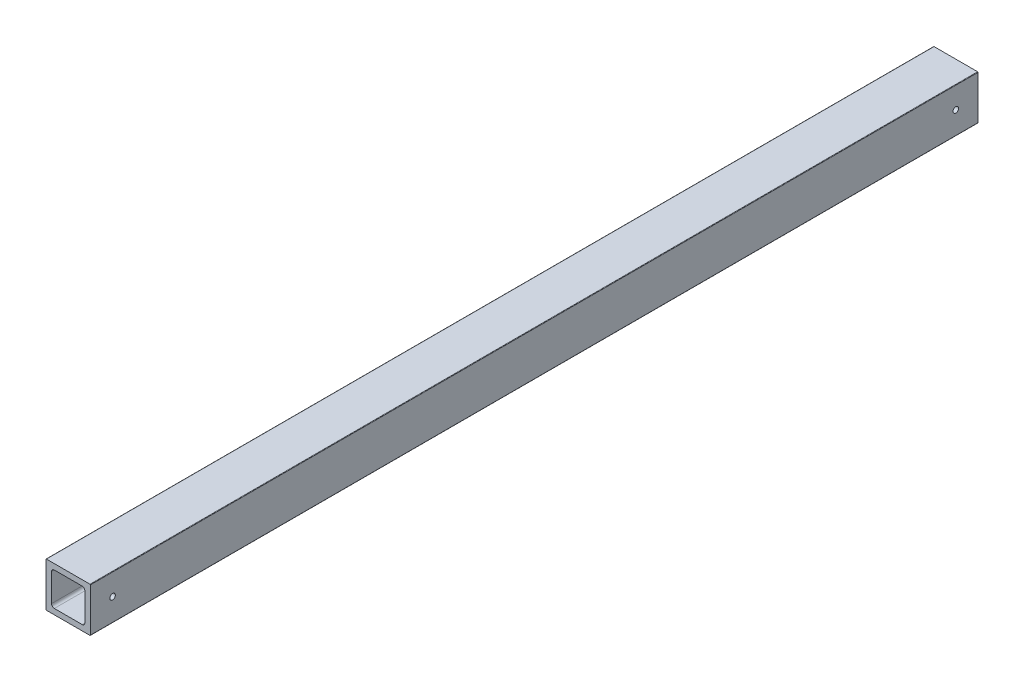
ISO-10303-21;
HEADER;
FILE_DESCRIPTION(('STEP AP214'),'2;1');
FILE_NAME('part.step','',(''),(''),'','','');
FILE_SCHEMA(('AUTOMOTIVE_DESIGN { 1 0 10303 214 1 1 1 1 }'));
ENDSEC;
DATA;
#1=APPLICATION_CONTEXT('core data for automotive mechanical design processes');
#2=APPLICATION_PROTOCOL_DEFINITION('international standard','automotive_design',2000,#1);
#3=PRODUCT_CONTEXT('',#1,'mechanical');
#4=PRODUCT('Part','Part','',(#3));
#5=PRODUCT_RELATED_PRODUCT_CATEGORY('part','',(#4));
#6=PRODUCT_DEFINITION_FORMATION('','',#4);
#7=PRODUCT_DEFINITION_CONTEXT('part definition',#1,'design');
#8=PRODUCT_DEFINITION('design','',#6,#7);
#9=PRODUCT_DEFINITION_SHAPE('','',#8);
#10=(LENGTH_UNIT() NAMED_UNIT(*) SI_UNIT(.MILLI.,.METRE.));
#11=(NAMED_UNIT(*) PLANE_ANGLE_UNIT() SI_UNIT($,.RADIAN.));
#12=(NAMED_UNIT(*) SI_UNIT($,.STERADIAN.) SOLID_ANGLE_UNIT());
#13=UNCERTAINTY_MEASURE_WITH_UNIT(LENGTH_MEASURE(1.E-05),#10,'distance_accuracy_value','');
#14=(GEOMETRIC_REPRESENTATION_CONTEXT(3) GLOBAL_UNCERTAINTY_ASSIGNED_CONTEXT((#13)) GLOBAL_UNIT_ASSIGNED_CONTEXT((#10,
#11,#12)) REPRESENTATION_CONTEXT('',''));
#15=CARTESIAN_POINT('',(0.,0.,0.));
#16=DIRECTION('',(0.,0.,1.));
#17=DIRECTION('',(1.,0.,0.));
#18=AXIS2_PLACEMENT_3D('',#15,#16,#17);
#19=CARTESIAN_POINT('',(0.253999999999993,0.253999999999998,508.));
#20=DIRECTION('',(0.,0.,-1.));
#21=DIRECTION('',(-1.,0.,0.));
#22=AXIS2_PLACEMENT_3D('',#19,#20,#21);
#23=CYLINDRICAL_SURFACE('',#22,0.253999999999997);
#24=CARTESIAN_POINT('',(0.253999999999993,0.253999999999998,0.));
#25=DIRECTION('',(0.,0.,-1.));
#26=DIRECTION('',(-1.,0.,0.));
#27=AXIS2_PLACEMENT_3D('',#24,#25,#26);
#28=CIRCLE('',#27,0.253999999999997);
#29=CARTESIAN_POINT('',(0.253999999999993,0.,0.));
#30=VERTEX_POINT('',#29);
#31=CARTESIAN_POINT('',(0.,0.253999999999998,0.));
#32=VERTEX_POINT('',#31);
#33=EDGE_CURVE('E206',#30,#32,#28,.T.);
#34=ORIENTED_EDGE('',*,*,#33,.F.);
#35=DIRECTION('',(0.,0.,-1.));
#36=VECTOR('',#35,1.);
#37=CARTESIAN_POINT('',(0.253999999999993,0.,508.));
#38=LINE('',#37,#36);
#39=CARTESIAN_POINT('',(0.253999999999993,0.,508.));
#40=VERTEX_POINT('',#39);
#41=EDGE_CURVE('E11',#40,#30,#38,.T.);
#42=ORIENTED_EDGE('',*,*,#41,.F.);
#43=CARTESIAN_POINT('',(0.253999999999993,0.253999999999998,508.));
#44=DIRECTION('',(0.,0.,-1.));
#45=DIRECTION('',(-1.,0.,0.));
#46=AXIS2_PLACEMENT_3D('',#43,#44,#45);
#47=CIRCLE('',#46,0.253999999999997);
#48=CARTESIAN_POINT('',(0.,0.253999999999998,508.));
#49=VERTEX_POINT('',#48);
#50=EDGE_CURVE('E218',#40,#49,#47,.T.);
#51=ORIENTED_EDGE('',*,*,#50,.T.);
#52=DIRECTION('',(0.,0.,-1.));
#53=VECTOR('',#52,1.);
#54=CARTESIAN_POINT('',(0.,0.253999999999998,508.));
#55=LINE('',#54,#53);
#56=EDGE_CURVE('E243',#49,#32,#55,.T.);
#57=ORIENTED_EDGE('',*,*,#56,.T.);
#58=EDGE_LOOP('',(#34,#42,#51,#57));
#59=FACE_BOUND('',#58,.T.);
#60=ADVANCED_FACE('F33',(#59),#23,.T.);
#61=CARTESIAN_POINT('',(25.146,0.,508.));
#62=DIRECTION('',(0.,-1.,0.));
#63=DIRECTION('',(1.,0.,0.));
#64=AXIS2_PLACEMENT_3D('',#61,#62,#63);
#65=PLANE('',#64);
#66=DIRECTION('',(-1.,0.,0.));
#67=VECTOR('',#66,1.);
#68=CARTESIAN_POINT('',(25.146,0.,0.));
#69=LINE('',#68,#67);
#70=CARTESIAN_POINT('',(25.146,0.,0.));
#71=VERTEX_POINT('',#70);
#72=EDGE_CURVE('E222',#71,#30,#69,.T.);
#73=ORIENTED_EDGE('',*,*,#72,.F.);
#74=DIRECTION('',(0.,0.,-1.));
#75=VECTOR('',#74,1.);
#76=CARTESIAN_POINT('',(25.146,0.,508.));
#77=LINE('',#76,#75);
#78=CARTESIAN_POINT('',(25.146,0.,508.));
#79=VERTEX_POINT('',#78);
#80=EDGE_CURVE('E41',#79,#71,#77,.T.);
#81=ORIENTED_EDGE('',*,*,#80,.F.);
#82=DIRECTION('',(-1.,0.,0.));
#83=VECTOR('',#82,1.);
#84=CARTESIAN_POINT('',(25.146,0.,508.));
#85=LINE('',#84,#83);
#86=EDGE_CURVE('E240',#79,#40,#85,.T.);
#87=ORIENTED_EDGE('',*,*,#86,.T.);
#88=ORIENTED_EDGE('',*,*,#41,.T.);
#89=EDGE_LOOP('',(#73,#81,#87,#88));
#90=FACE_BOUND('',#89,.T.);
#91=ADVANCED_FACE('F320',(#90),#65,.T.);
#92=CARTESIAN_POINT('',(25.146,0.254,508.));
#93=DIRECTION('',(0.,0.,-1.));
#94=DIRECTION('',(-1.,0.,0.));
#95=AXIS2_PLACEMENT_3D('',#92,#93,#94);
#96=CYLINDRICAL_SURFACE('',#95,0.253999999999999);
#97=CARTESIAN_POINT('',(25.146,0.254,0.));
#98=DIRECTION('',(0.,0.,-1.));
#99=DIRECTION('',(-1.,0.,0.));
#100=AXIS2_PLACEMENT_3D('',#97,#98,#99);
#101=CIRCLE('',#100,0.253999999999999);
#102=CARTESIAN_POINT('',(25.4,0.254,0.));
#103=VERTEX_POINT('',#102);
#104=EDGE_CURVE('E261',#103,#71,#101,.T.);
#105=ORIENTED_EDGE('',*,*,#104,.F.);
#106=DIRECTION('',(0.,0.,-1.));
#107=VECTOR('',#106,1.);
#108=CARTESIAN_POINT('',(25.4,0.254,508.));
#109=LINE('',#108,#107);
#110=CARTESIAN_POINT('',(25.4,0.254,508.));
#111=VERTEX_POINT('',#110);
#112=EDGE_CURVE('E267',#111,#103,#109,.T.);
#113=ORIENTED_EDGE('',*,*,#112,.F.);
#114=CARTESIAN_POINT('',(25.146,0.254,508.));
#115=DIRECTION('',(0.,0.,-1.));
#116=DIRECTION('',(-1.,0.,0.));
#117=AXIS2_PLACEMENT_3D('',#114,#115,#116);
#118=CIRCLE('',#117,0.253999999999999);
#119=EDGE_CURVE('E237',#111,#79,#118,.T.);
#120=ORIENTED_EDGE('',*,*,#119,.T.);
#121=ORIENTED_EDGE('',*,*,#80,.T.);
#122=EDGE_LOOP('',(#105,#113,#120,#121));
#123=FACE_BOUND('',#122,.T.);
#124=ADVANCED_FACE('F323',(#123),#96,.T.);
#125=CARTESIAN_POINT('',(25.4,25.146,508.));
#126=DIRECTION('',(1.,0.,0.));
#127=DIRECTION('',(0.,0.,-1.));
#128=AXIS2_PLACEMENT_3D('',#125,#126,#127);
#129=PLANE('',#128);
#130=CARTESIAN_POINT('',(25.4,12.954,12.6974597459492));
#131=DIRECTION('',(-1.,0.,0.));
#132=DIRECTION('',(0.,0.,1.));
#133=AXIS2_PLACEMENT_3D('',#130,#131,#132);
#134=CIRCLE('',#133,1.5875);
#135=CARTESIAN_POINT('',(25.4,12.954,14.2849597459492));
#136=VERTEX_POINT('',#135);
#137=EDGE_CURVE('E280',#136,#136,#134,.T.);
#138=ORIENTED_EDGE('',*,*,#137,.T.);
#139=EDGE_LOOP('',(#138));
#140=FACE_BOUND('',#139,.T.);
#141=CARTESIAN_POINT('',(25.4,12.954,495.3));
#142=DIRECTION('',(-1.,0.,0.));
#143=DIRECTION('',(0.,0.,1.));
#144=AXIS2_PLACEMENT_3D('',#141,#142,#143);
#145=CIRCLE('',#144,1.58750000000004);
#146=CARTESIAN_POINT('',(25.4,12.954,496.8875));
#147=VERTEX_POINT('',#146);
#148=EDGE_CURVE('E290',#147,#147,#145,.T.);
#149=ORIENTED_EDGE('',*,*,#148,.T.);
#150=EDGE_LOOP('',(#149));
#151=FACE_BOUND('',#150,.T.);
#152=DIRECTION('',(0.,-1.,0.));
#153=VECTOR('',#152,1.);
#154=CARTESIAN_POINT('',(25.4,25.146,0.));
#155=LINE('',#154,#153);
#156=CARTESIAN_POINT('',(25.4,25.146,0.));
#157=VERTEX_POINT('',#156);
#158=EDGE_CURVE('E258',#157,#103,#155,.T.);
#159=ORIENTED_EDGE('',*,*,#158,.F.);
#160=DIRECTION('',(0.,0.,-1.));
#161=VECTOR('',#160,1.);
#162=CARTESIAN_POINT('',(25.4,25.146,508.));
#163=LINE('',#162,#161);
#164=CARTESIAN_POINT('',(25.4,25.146,508.));
#165=VERTEX_POINT('',#164);
#166=EDGE_CURVE('E269',#165,#157,#163,.T.);
#167=ORIENTED_EDGE('',*,*,#166,.F.);
#168=DIRECTION('',(0.,-1.,0.));
#169=VECTOR('',#168,1.);
#170=CARTESIAN_POINT('',(25.4,25.146,508.));
#171=LINE('',#170,#169);
#172=EDGE_CURVE('E234',#165,#111,#171,.T.);
#173=ORIENTED_EDGE('',*,*,#172,.T.);
#174=ORIENTED_EDGE('',*,*,#112,.T.);
#175=EDGE_LOOP('',(#159,#167,#173,#174));
#176=FACE_BOUND('',#175,.T.);
#177=ADVANCED_FACE('F328',(#140,#151,#176),#129,.T.);
#178=CARTESIAN_POINT('',(25.146,25.146,508.));
#179=DIRECTION('',(0.,0.,-1.));
#180=DIRECTION('',(-1.,0.,0.));
#181=AXIS2_PLACEMENT_3D('',#178,#179,#180);
#182=CYLINDRICAL_SURFACE('',#181,0.253999999999999);
#183=CARTESIAN_POINT('',(25.146,25.146,0.));
#184=DIRECTION('',(0.,0.,-1.));
#185=DIRECTION('',(-1.,0.,0.));
#186=AXIS2_PLACEMENT_3D('',#183,#184,#185);
#187=CIRCLE('',#186,0.253999999999999);
#188=CARTESIAN_POINT('',(25.146,25.4,0.));
#189=VERTEX_POINT('',#188);
#190=EDGE_CURVE('E255',#189,#157,#187,.T.);
#191=ORIENTED_EDGE('',*,*,#190,.F.);
#192=DIRECTION('',(0.,0.,-1.));
#193=VECTOR('',#192,1.);
#194=CARTESIAN_POINT('',(25.146,25.4,508.));
#195=LINE('',#194,#193);
#196=CARTESIAN_POINT('',(25.146,25.4,508.));
#197=VERTEX_POINT('',#196);
#198=EDGE_CURVE('E271',#197,#189,#195,.T.);
#199=ORIENTED_EDGE('',*,*,#198,.F.);
#200=CARTESIAN_POINT('',(25.146,25.146,508.));
#201=DIRECTION('',(0.,0.,-1.));
#202=DIRECTION('',(-1.,0.,0.));
#203=AXIS2_PLACEMENT_3D('',#200,#201,#202);
#204=CIRCLE('',#203,0.253999999999999);
#205=EDGE_CURVE('E231',#197,#165,#204,.T.);
#206=ORIENTED_EDGE('',*,*,#205,.T.);
#207=ORIENTED_EDGE('',*,*,#166,.T.);
#208=EDGE_LOOP('',(#191,#199,#206,#207));
#209=FACE_BOUND('',#208,.T.);
#210=ADVANCED_FACE('F331',(#209),#182,.T.);
#211=CARTESIAN_POINT('',(0.253999999999988,25.4,508.));
#212=DIRECTION('',(0.,1.,0.));
#213=DIRECTION('',(-1.,0.,0.));
#214=AXIS2_PLACEMENT_3D('',#211,#212,#213);
#215=PLANE('',#214);
#216=DIRECTION('',(1.,0.,0.));
#217=VECTOR('',#216,1.);
#218=CARTESIAN_POINT('',(0.253999999999988,25.4,0.));
#219=LINE('',#218,#217);
#220=CARTESIAN_POINT('',(0.253999999999988,25.4,0.));
#221=VERTEX_POINT('',#220);
#222=EDGE_CURVE('E252',#221,#189,#219,.T.);
#223=ORIENTED_EDGE('',*,*,#222,.F.);
#224=DIRECTION('',(0.,0.,-1.));
#225=VECTOR('',#224,1.);
#226=CARTESIAN_POINT('',(0.253999999999988,25.4,508.));
#227=LINE('',#226,#225);
#228=CARTESIAN_POINT('',(0.253999999999988,25.4,508.));
#229=VERTEX_POINT('',#228);
#230=EDGE_CURVE('E273',#229,#221,#227,.T.);
#231=ORIENTED_EDGE('',*,*,#230,.F.);
#232=DIRECTION('',(1.,0.,0.));
#233=VECTOR('',#232,1.);
#234=CARTESIAN_POINT('',(0.253999999999988,25.4,508.));
#235=LINE('',#234,#233);
#236=EDGE_CURVE('E228',#229,#197,#235,.T.);
#237=ORIENTED_EDGE('',*,*,#236,.T.);
#238=ORIENTED_EDGE('',*,*,#198,.T.);
#239=EDGE_LOOP('',(#223,#231,#237,#238));
#240=FACE_BOUND('',#239,.T.);
#241=ADVANCED_FACE('F335',(#240),#215,.T.);
#242=CARTESIAN_POINT('',(0.253999999999988,25.146,508.));
#243=DIRECTION('',(0.,0.,-1.));
#244=DIRECTION('',(-1.,0.,0.));
#245=AXIS2_PLACEMENT_3D('',#242,#243,#244);
#246=CYLINDRICAL_SURFACE('',#245,0.253999999999991);
#247=CARTESIAN_POINT('',(0.253999999999988,25.146,0.));
#248=DIRECTION('',(0.,0.,-1.));
#249=DIRECTION('',(-1.,0.,0.));
#250=AXIS2_PLACEMENT_3D('',#247,#248,#249);
#251=CIRCLE('',#250,0.253999999999991);
#252=CARTESIAN_POINT('',(0.,25.146,0.));
#253=VERTEX_POINT('',#252);
#254=EDGE_CURVE('E249',#253,#221,#251,.T.);
#255=ORIENTED_EDGE('',*,*,#254,.F.);
#256=DIRECTION('',(0.,0.,-1.));
#257=VECTOR('',#256,1.);
#258=CARTESIAN_POINT('',(0.,25.146,508.));
#259=LINE('',#258,#257);
#260=CARTESIAN_POINT('',(0.,25.146,508.));
#261=VERTEX_POINT('',#260);
#262=EDGE_CURVE('E275',#261,#253,#259,.T.);
#263=ORIENTED_EDGE('',*,*,#262,.F.);
#264=CARTESIAN_POINT('',(0.253999999999988,25.146,508.));
#265=DIRECTION('',(0.,0.,-1.));
#266=DIRECTION('',(-1.,0.,0.));
#267=AXIS2_PLACEMENT_3D('',#264,#265,#266);
#268=CIRCLE('',#267,0.253999999999991);
#269=EDGE_CURVE('E225',#261,#229,#268,.T.);
#270=ORIENTED_EDGE('',*,*,#269,.T.);
#271=ORIENTED_EDGE('',*,*,#230,.T.);
#272=EDGE_LOOP('',(#255,#263,#270,#271));
#273=FACE_BOUND('',#272,.T.);
#274=ADVANCED_FACE('F305',(#273),#246,.T.);
#275=CARTESIAN_POINT('',(0.,0.253999999999998,508.));
#276=DIRECTION('',(-1.,0.,0.));
#277=DIRECTION('',(0.,0.,1.));
#278=AXIS2_PLACEMENT_3D('',#275,#276,#277);
#279=PLANE('',#278);
#280=CARTESIAN_POINT('',(0.,12.954,12.6974597459492));
#281=DIRECTION('',(-1.,0.,0.));
#282=DIRECTION('',(0.,0.,1.));
#283=AXIS2_PLACEMENT_3D('',#280,#281,#282);
#284=CIRCLE('',#283,1.5875);
#285=CARTESIAN_POINT('',(0.,12.954,14.2849597459492));
#286=VERTEX_POINT('',#285);
#287=EDGE_CURVE('E285',#286,#286,#284,.T.);
#288=ORIENTED_EDGE('',*,*,#287,.F.);
#289=EDGE_LOOP('',(#288));
#290=FACE_BOUND('',#289,.T.);
#291=CARTESIAN_POINT('',(0.,12.954,495.3));
#292=DIRECTION('',(-1.,0.,0.));
#293=DIRECTION('',(0.,0.,1.));
#294=AXIS2_PLACEMENT_3D('',#291,#292,#293);
#295=CIRCLE('',#294,1.58750000000004);
#296=CARTESIAN_POINT('',(0.,12.954,496.8875));
#297=VERTEX_POINT('',#296);
#298=EDGE_CURVE('E295',#297,#297,#295,.T.);
#299=ORIENTED_EDGE('',*,*,#298,.F.);
#300=EDGE_LOOP('',(#299));
#301=FACE_BOUND('',#300,.T.);
#302=DIRECTION('',(0.,1.,0.));
#303=VECTOR('',#302,1.);
#304=CARTESIAN_POINT('',(0.,0.253999999999998,0.));
#305=LINE('',#304,#303);
#306=EDGE_CURVE('E246',#32,#253,#305,.T.);
#307=ORIENTED_EDGE('',*,*,#306,.F.);
#308=ORIENTED_EDGE('',*,*,#56,.F.);
#309=DIRECTION('',(0.,1.,0.));
#310=VECTOR('',#309,1.);
#311=CARTESIAN_POINT('',(0.,0.253999999999998,508.));
#312=LINE('',#311,#310);
#313=EDGE_CURVE('E221',#49,#261,#312,.T.);
#314=ORIENTED_EDGE('',*,*,#313,.T.);
#315=ORIENTED_EDGE('',*,*,#262,.T.);
#316=EDGE_LOOP('',(#307,#308,#314,#315));
#317=FACE_BOUND('',#316,.T.);
#318=ADVANCED_FACE('F302',(#290,#301,#317),#279,.T.);
#319=CARTESIAN_POINT('',(0.253999999999993,0.253999999999998,508.));
#320=DIRECTION('',(0.,0.,-1.));
#321=DIRECTION('',(-1.,0.,0.));
#322=AXIS2_PLACEMENT_3D('',#319,#320,#321);
#323=PLANE('',#322);
#324=DIRECTION('',(0.,1.,0.));
#325=VECTOR('',#324,1.);
#326=CARTESIAN_POINT('',(3.175,20.6375,508.));
#327=LINE('',#326,#325);
#328=CARTESIAN_POINT('',(3.175,4.7625,508.));
#329=VERTEX_POINT('',#328);
#330=CARTESIAN_POINT('',(3.175,20.6375,508.));
#331=VERTEX_POINT('',#330);
#332=EDGE_CURVE('E154',#329,#331,#327,.T.);
#333=ORIENTED_EDGE('',*,*,#332,.T.);
#334=CARTESIAN_POINT('',(4.76250000000001,20.6375,508.));
#335=DIRECTION('',(0.,0.,-1.));
#336=DIRECTION('',(1.,0.,0.));
#337=AXIS2_PLACEMENT_3D('',#334,#335,#336);
#338=CIRCLE('',#337,1.58750000000001);
#339=CARTESIAN_POINT('',(4.76250000000001,22.225,508.));
#340=VERTEX_POINT('',#339);
#341=EDGE_CURVE('E148',#331,#340,#338,.T.);
#342=ORIENTED_EDGE('',*,*,#341,.T.);
#343=DIRECTION('',(1.,0.,0.));
#344=VECTOR('',#343,1.);
#345=CARTESIAN_POINT('',(20.6375,22.225,508.));
#346=LINE('',#345,#344);
#347=CARTESIAN_POINT('',(20.6375,22.225,508.));
#348=VERTEX_POINT('',#347);
#349=EDGE_CURVE('E157',#340,#348,#346,.T.);
#350=ORIENTED_EDGE('',*,*,#349,.T.);
#351=CARTESIAN_POINT('',(20.6375,20.6375,508.));
#352=DIRECTION('',(0.,0.,-1.));
#353=DIRECTION('',(1.,0.,0.));
#354=AXIS2_PLACEMENT_3D('',#351,#352,#353);
#355=CIRCLE('',#354,1.5875);
#356=CARTESIAN_POINT('',(22.225,20.6375,508.));
#357=VERTEX_POINT('',#356);
#358=EDGE_CURVE('E49',#348,#357,#355,.T.);
#359=ORIENTED_EDGE('',*,*,#358,.T.);
#360=DIRECTION('',(0.,-1.,0.));
#361=VECTOR('',#360,1.);
#362=CARTESIAN_POINT('',(22.225,4.7625,508.));
#363=LINE('',#362,#361);
#364=CARTESIAN_POINT('',(22.225,4.7625,508.));
#365=VERTEX_POINT('',#364);
#366=EDGE_CURVE('E175',#357,#365,#363,.T.);
#367=ORIENTED_EDGE('',*,*,#366,.T.);
#368=CARTESIAN_POINT('',(20.6375,4.7625,508.));
#369=DIRECTION('',(0.,0.,-1.));
#370=DIRECTION('',(1.,0.,0.));
#371=AXIS2_PLACEMENT_3D('',#368,#369,#370);
#372=CIRCLE('',#371,1.5875);
#373=CARTESIAN_POINT('',(20.6375,3.175,508.));
#374=VERTEX_POINT('',#373);
#375=EDGE_CURVE('E178',#365,#374,#372,.T.);
#376=ORIENTED_EDGE('',*,*,#375,.T.);
#377=DIRECTION('',(-1.,0.,0.));
#378=VECTOR('',#377,1.);
#379=CARTESIAN_POINT('',(4.7625,3.175,508.));
#380=LINE('',#379,#378);
#381=CARTESIAN_POINT('',(4.7625,3.175,508.));
#382=VERTEX_POINT('',#381);
#383=EDGE_CURVE('E181',#374,#382,#380,.T.);
#384=ORIENTED_EDGE('',*,*,#383,.T.);
#385=CARTESIAN_POINT('',(4.7625,4.7625,508.));
#386=DIRECTION('',(0.,0.,-1.));
#387=DIRECTION('',(1.,0.,0.));
#388=AXIS2_PLACEMENT_3D('',#385,#386,#387);
#389=CIRCLE('',#388,1.5875);
#390=EDGE_CURVE('E184',#382,#329,#389,.T.);
#391=ORIENTED_EDGE('',*,*,#390,.T.);
#392=EDGE_LOOP('',(#333,#342,#350,#359,#367,#376,#384,#391));
#393=FACE_BOUND('',#392,.T.);
#394=ORIENTED_EDGE('',*,*,#50,.F.);
#395=ORIENTED_EDGE('',*,*,#86,.F.);
#396=ORIENTED_EDGE('',*,*,#119,.F.);
#397=ORIENTED_EDGE('',*,*,#172,.F.);
#398=ORIENTED_EDGE('',*,*,#205,.F.);
#399=ORIENTED_EDGE('',*,*,#236,.F.);
#400=ORIENTED_EDGE('',*,*,#269,.F.);
#401=ORIENTED_EDGE('',*,*,#313,.F.);
#402=EDGE_LOOP('',(#394,#395,#396,#397,#398,#399,#400,#401));
#403=FACE_BOUND('',#402,.T.);
#404=ADVANCED_FACE('F161',(#393,#403),#323,.F.);
#405=CARTESIAN_POINT('',(0.253999999999993,0.253999999999998,0.));
#406=DIRECTION('',(0.,0.,-1.));
#407=DIRECTION('',(-1.,0.,0.));
#408=AXIS2_PLACEMENT_3D('',#405,#406,#407);
#409=PLANE('',#408);
#410=CARTESIAN_POINT('',(4.76250000000001,20.6375,0.));
#411=DIRECTION('',(0.,0.,-1.));
#412=DIRECTION('',(1.,0.,0.));
#413=AXIS2_PLACEMENT_3D('',#410,#411,#412);
#414=CIRCLE('',#413,1.58750000000001);
#415=CARTESIAN_POINT('',(3.175,20.6375,0.));
#416=VERTEX_POINT('',#415);
#417=CARTESIAN_POINT('',(4.76250000000001,22.225,0.));
#418=VERTEX_POINT('',#417);
#419=EDGE_CURVE('E57',#416,#418,#414,.T.);
#420=ORIENTED_EDGE('',*,*,#419,.F.);
#421=DIRECTION('',(0.,1.,0.));
#422=VECTOR('',#421,1.);
#423=CARTESIAN_POINT('',(3.175,20.6375,0.));
#424=LINE('',#423,#422);
#425=CARTESIAN_POINT('',(3.175,4.7625,0.));
#426=VERTEX_POINT('',#425);
#427=EDGE_CURVE('E165',#426,#416,#424,.T.);
#428=ORIENTED_EDGE('',*,*,#427,.F.);
#429=CARTESIAN_POINT('',(4.7625,4.7625,0.));
#430=DIRECTION('',(0.,0.,-1.));
#431=DIRECTION('',(1.,0.,0.));
#432=AXIS2_PLACEMENT_3D('',#429,#430,#431);
#433=CIRCLE('',#432,1.5875);
#434=CARTESIAN_POINT('',(4.7625,3.175,0.));
#435=VERTEX_POINT('',#434);
#436=EDGE_CURVE('E168',#435,#426,#433,.T.);
#437=ORIENTED_EDGE('',*,*,#436,.F.);
#438=DIRECTION('',(-1.,0.,0.));
#439=VECTOR('',#438,1.);
#440=CARTESIAN_POINT('',(4.7625,3.175,0.));
#441=LINE('',#440,#439);
#442=CARTESIAN_POINT('',(20.6375,3.175,0.));
#443=VERTEX_POINT('',#442);
#444=EDGE_CURVE('E199',#443,#435,#441,.T.);
#445=ORIENTED_EDGE('',*,*,#444,.F.);
#446=CARTESIAN_POINT('',(20.6375,4.7625,0.));
#447=DIRECTION('',(0.,0.,-1.));
#448=DIRECTION('',(1.,0.,0.));
#449=AXIS2_PLACEMENT_3D('',#446,#447,#448);
#450=CIRCLE('',#449,1.5875);
#451=CARTESIAN_POINT('',(22.225,4.7625,0.));
#452=VERTEX_POINT('',#451);
#453=EDGE_CURVE('E196',#452,#443,#450,.T.);
#454=ORIENTED_EDGE('',*,*,#453,.F.);
#455=DIRECTION('',(0.,-1.,0.));
#456=VECTOR('',#455,1.);
#457=CARTESIAN_POINT('',(22.225,4.7625,0.));
#458=LINE('',#457,#456);
#459=CARTESIAN_POINT('',(22.225,20.6375,0.));
#460=VERTEX_POINT('',#459);
#461=EDGE_CURVE('E193',#460,#452,#458,.T.);
#462=ORIENTED_EDGE('',*,*,#461,.F.);
#463=CARTESIAN_POINT('',(20.6375,20.6375,0.));
#464=DIRECTION('',(0.,0.,-1.));
#465=DIRECTION('',(1.,0.,0.));
#466=AXIS2_PLACEMENT_3D('',#463,#464,#465);
#467=CIRCLE('',#466,1.5875);
#468=CARTESIAN_POINT('',(20.6375,22.225,0.));
#469=VERTEX_POINT('',#468);
#470=EDGE_CURVE('E190',#469,#460,#467,.T.);
#471=ORIENTED_EDGE('',*,*,#470,.F.);
#472=DIRECTION('',(1.,0.,0.));
#473=VECTOR('',#472,1.);
#474=CARTESIAN_POINT('',(20.6375,22.225,0.));
#475=LINE('',#474,#473);
#476=EDGE_CURVE('E188',#418,#469,#475,.T.);
#477=ORIENTED_EDGE('',*,*,#476,.F.);
#478=EDGE_LOOP('',(#420,#428,#437,#445,#454,#462,#471,#477));
#479=FACE_BOUND('',#478,.T.);
#480=ORIENTED_EDGE('',*,*,#33,.T.);
#481=ORIENTED_EDGE('',*,*,#306,.T.);
#482=ORIENTED_EDGE('',*,*,#254,.T.);
#483=ORIENTED_EDGE('',*,*,#222,.T.);
#484=ORIENTED_EDGE('',*,*,#190,.T.);
#485=ORIENTED_EDGE('',*,*,#158,.T.);
#486=ORIENTED_EDGE('',*,*,#104,.T.);
#487=ORIENTED_EDGE('',*,*,#72,.T.);
#488=EDGE_LOOP('',(#480,#481,#482,#483,#484,#485,#486,#487));
#489=FACE_BOUND('',#488,.T.);
#490=ADVANCED_FACE('F312',(#479,#489),#409,.T.);
#491=CARTESIAN_POINT('',(4.76250000000001,20.6375,508.));
#492=DIRECTION('',(0.,0.,-1.));
#493=DIRECTION('',(-1.,0.,0.));
#494=AXIS2_PLACEMENT_3D('',#491,#492,#493);
#495=CYLINDRICAL_SURFACE('',#494,1.58750000000001);
#496=ORIENTED_EDGE('',*,*,#419,.T.);
#497=DIRECTION('',(0.,0.,-1.));
#498=VECTOR('',#497,1.);
#499=CARTESIAN_POINT('',(4.76250000000001,22.225,508.));
#500=LINE('',#499,#498);
#501=EDGE_CURVE('E144',#340,#418,#500,.T.);
#502=ORIENTED_EDGE('',*,*,#501,.F.);
#503=ORIENTED_EDGE('',*,*,#341,.F.);
#504=DIRECTION('',(0.,0.,-1.));
#505=VECTOR('',#504,1.);
#506=CARTESIAN_POINT('',(3.175,20.6375,508.));
#507=LINE('',#506,#505);
#508=EDGE_CURVE('E204',#331,#416,#507,.T.);
#509=ORIENTED_EDGE('',*,*,#508,.T.);
#510=EDGE_LOOP('',(#496,#502,#503,#509));
#511=FACE_BOUND('',#510,.T.);
#512=ADVANCED_FACE('F146',(#511),#495,.F.);
#513=CARTESIAN_POINT('',(3.175,20.6375,508.));
#514=DIRECTION('',(-1.,0.,0.));
#515=DIRECTION('',(0.,-1.,0.));
#516=AXIS2_PLACEMENT_3D('',#513,#514,#515);
#517=PLANE('',#516);
#518=CARTESIAN_POINT('',(3.175,12.954,12.6974597459492));
#519=DIRECTION('',(-1.,0.,0.));
#520=DIRECTION('',(0.,-1.,0.));
#521=AXIS2_PLACEMENT_3D('',#518,#519,#520);
#522=CIRCLE('',#521,1.5875);
#523=CARTESIAN_POINT('',(3.175,11.3665,12.6974597459492));
#524=VERTEX_POINT('',#523);
#525=EDGE_CURVE('E171',#524,#524,#522,.T.);
#526=ORIENTED_EDGE('',*,*,#525,.T.);
#527=EDGE_LOOP('',(#526));
#528=FACE_BOUND('',#527,.T.);
#529=CARTESIAN_POINT('',(3.175,12.954,495.3));
#530=DIRECTION('',(-1.,0.,0.));
#531=DIRECTION('',(0.,-1.,0.));
#532=AXIS2_PLACEMENT_3D('',#529,#530,#531);
#533=CIRCLE('',#532,1.58750000000004);
#534=CARTESIAN_POINT('',(3.175,11.3665,495.3));
#535=VERTEX_POINT('',#534);
#536=EDGE_CURVE('E279',#535,#535,#533,.T.);
#537=ORIENTED_EDGE('',*,*,#536,.T.);
#538=EDGE_LOOP('',(#537));
#539=FACE_BOUND('',#538,.T.);
#540=ORIENTED_EDGE('',*,*,#427,.T.);
#541=ORIENTED_EDGE('',*,*,#508,.F.);
#542=ORIENTED_EDGE('',*,*,#332,.F.);
#543=DIRECTION('',(0.,0.,-1.));
#544=VECTOR('',#543,1.);
#545=CARTESIAN_POINT('',(3.175,4.7625,508.));
#546=LINE('',#545,#544);
#547=EDGE_CURVE('E207',#329,#426,#546,.T.);
#548=ORIENTED_EDGE('',*,*,#547,.T.);
#549=EDGE_LOOP('',(#540,#541,#542,#548));
#550=FACE_BOUND('',#549,.T.);
#551=ADVANCED_FACE('F396',(#528,#539,#550),#517,.F.);
#552=CARTESIAN_POINT('',(4.7625,4.7625,508.));
#553=DIRECTION('',(0.,0.,-1.));
#554=DIRECTION('',(-1.,0.,0.));
#555=AXIS2_PLACEMENT_3D('',#552,#553,#554);
#556=CYLINDRICAL_SURFACE('',#555,1.5875);
#557=ORIENTED_EDGE('',*,*,#436,.T.);
#558=ORIENTED_EDGE('',*,*,#547,.F.);
#559=ORIENTED_EDGE('',*,*,#390,.F.);
#560=DIRECTION('',(0.,0.,-1.));
#561=VECTOR('',#560,1.);
#562=CARTESIAN_POINT('',(4.7625,3.175,508.));
#563=LINE('',#562,#561);
#564=EDGE_CURVE('E209',#382,#435,#563,.T.);
#565=ORIENTED_EDGE('',*,*,#564,.T.);
#566=EDGE_LOOP('',(#557,#558,#559,#565));
#567=FACE_BOUND('',#566,.T.);
#568=ADVANCED_FACE('F403',(#567),#556,.F.);
#569=CARTESIAN_POINT('',(4.7625,3.175,508.));
#570=DIRECTION('',(0.,-1.,0.));
#571=DIRECTION('',(1.,0.,0.));
#572=AXIS2_PLACEMENT_3D('',#569,#570,#571);
#573=PLANE('',#572);
#574=ORIENTED_EDGE('',*,*,#444,.T.);
#575=ORIENTED_EDGE('',*,*,#564,.F.);
#576=ORIENTED_EDGE('',*,*,#383,.F.);
#577=DIRECTION('',(0.,0.,-1.));
#578=VECTOR('',#577,1.);
#579=CARTESIAN_POINT('',(20.6375,3.175,508.));
#580=LINE('',#579,#578);
#581=EDGE_CURVE('E211',#374,#443,#580,.T.);
#582=ORIENTED_EDGE('',*,*,#581,.T.);
#583=EDGE_LOOP('',(#574,#575,#576,#582));
#584=FACE_BOUND('',#583,.T.);
#585=ADVANCED_FACE('F408',(#584),#573,.F.);
#586=CARTESIAN_POINT('',(20.6375,4.7625,508.));
#587=DIRECTION('',(0.,0.,-1.));
#588=DIRECTION('',(-1.,0.,0.));
#589=AXIS2_PLACEMENT_3D('',#586,#587,#588);
#590=CYLINDRICAL_SURFACE('',#589,1.5875);
#591=ORIENTED_EDGE('',*,*,#453,.T.);
#592=ORIENTED_EDGE('',*,*,#581,.F.);
#593=ORIENTED_EDGE('',*,*,#375,.F.);
#594=DIRECTION('',(0.,0.,-1.));
#595=VECTOR('',#594,1.);
#596=CARTESIAN_POINT('',(22.225,4.7625,508.));
#597=LINE('',#596,#595);
#598=EDGE_CURVE('E213',#365,#452,#597,.T.);
#599=ORIENTED_EDGE('',*,*,#598,.T.);
#600=EDGE_LOOP('',(#591,#592,#593,#599));
#601=FACE_BOUND('',#600,.T.);
#602=ADVANCED_FACE('F418',(#601),#590,.F.);
#603=CARTESIAN_POINT('',(22.225,4.7625,508.));
#604=DIRECTION('',(1.,0.,0.));
#605=DIRECTION('',(0.,1.,0.));
#606=AXIS2_PLACEMENT_3D('',#603,#604,#605);
#607=PLANE('',#606);
#608=CARTESIAN_POINT('',(22.225,12.954,12.6974597459492));
#609=DIRECTION('',(1.,0.,0.));
#610=DIRECTION('',(0.,1.,0.));
#611=AXIS2_PLACEMENT_3D('',#608,#609,#610);
#612=CIRCLE('',#611,1.5875);
#613=CARTESIAN_POINT('',(22.225,14.5415,12.6974597459492));
#614=VERTEX_POINT('',#613);
#615=EDGE_CURVE('E36',#614,#614,#612,.T.);
#616=ORIENTED_EDGE('',*,*,#615,.T.);
#617=EDGE_LOOP('',(#616));
#618=FACE_BOUND('',#617,.T.);
#619=CARTESIAN_POINT('',(22.225,12.954,495.3));
#620=DIRECTION('',(1.,0.,0.));
#621=DIRECTION('',(0.,1.,0.));
#622=AXIS2_PLACEMENT_3D('',#619,#620,#621);
#623=CIRCLE('',#622,1.58750000000004);
#624=CARTESIAN_POINT('',(22.225,14.5415,495.3));
#625=VERTEX_POINT('',#624);
#626=EDGE_CURVE('E277',#625,#625,#623,.T.);
#627=ORIENTED_EDGE('',*,*,#626,.T.);
#628=EDGE_LOOP('',(#627));
#629=FACE_BOUND('',#628,.T.);
#630=ORIENTED_EDGE('',*,*,#461,.T.);
#631=ORIENTED_EDGE('',*,*,#598,.F.);
#632=ORIENTED_EDGE('',*,*,#366,.F.);
#633=DIRECTION('',(0.,0.,-1.));
#634=VECTOR('',#633,1.);
#635=CARTESIAN_POINT('',(22.225,20.6375,508.));
#636=LINE('',#635,#634);
#637=EDGE_CURVE('E215',#357,#460,#636,.T.);
#638=ORIENTED_EDGE('',*,*,#637,.T.);
#639=EDGE_LOOP('',(#630,#631,#632,#638));
#640=FACE_BOUND('',#639,.T.);
#641=ADVANCED_FACE('F428',(#618,#629,#640),#607,.F.);
#642=CARTESIAN_POINT('',(20.6375,20.6375,508.));
#643=DIRECTION('',(0.,0.,-1.));
#644=DIRECTION('',(-1.,0.,0.));
#645=AXIS2_PLACEMENT_3D('',#642,#643,#644);
#646=CYLINDRICAL_SURFACE('',#645,1.5875);
#647=ORIENTED_EDGE('',*,*,#470,.T.);
#648=ORIENTED_EDGE('',*,*,#637,.F.);
#649=ORIENTED_EDGE('',*,*,#358,.F.);
#650=DIRECTION('',(0.,0.,-1.));
#651=VECTOR('',#650,1.);
#652=CARTESIAN_POINT('',(20.6375,22.225,508.));
#653=LINE('',#652,#651);
#654=EDGE_CURVE('E153',#348,#469,#653,.T.);
#655=ORIENTED_EDGE('',*,*,#654,.T.);
#656=EDGE_LOOP('',(#647,#648,#649,#655));
#657=FACE_BOUND('',#656,.T.);
#658=ADVANCED_FACE('F436',(#657),#646,.F.);
#659=CARTESIAN_POINT('',(20.6375,22.225,508.));
#660=DIRECTION('',(0.,1.,0.));
#661=DIRECTION('',(-1.,0.,0.));
#662=AXIS2_PLACEMENT_3D('',#659,#660,#661);
#663=PLANE('',#662);
#664=ORIENTED_EDGE('',*,*,#476,.T.);
#665=ORIENTED_EDGE('',*,*,#654,.F.);
#666=ORIENTED_EDGE('',*,*,#349,.F.);
#667=ORIENTED_EDGE('',*,*,#501,.T.);
#668=EDGE_LOOP('',(#664,#665,#666,#667));
#669=FACE_BOUND('',#668,.T.);
#670=ADVANCED_FACE('F158',(#669),#663,.F.);
#671=CARTESIAN_POINT('',(25.4,12.954,495.3));
#672=DIRECTION('',(-1.,0.,0.));
#673=DIRECTION('',(0.,0.,1.));
#674=AXIS2_PLACEMENT_3D('',#671,#672,#673);
#675=CYLINDRICAL_SURFACE('',#674,1.58750000000004);
#676=ORIENTED_EDGE('',*,*,#148,.F.);
#677=EDGE_LOOP('',(#676));
#678=FACE_BOUND('',#677,.T.);
#679=ORIENTED_EDGE('',*,*,#626,.F.);
#680=EDGE_LOOP('',(#679));
#681=FACE_BOUND('',#680,.T.);
#682=ADVANCED_FACE('F448',(#678,#681),#675,.F.);
#683=CARTESIAN_POINT('',(25.4,12.954,12.6974597459492));
#684=DIRECTION('',(-1.,0.,0.));
#685=DIRECTION('',(0.,0.,1.));
#686=AXIS2_PLACEMENT_3D('',#683,#684,#685);
#687=CYLINDRICAL_SURFACE('',#686,1.5875);
#688=ORIENTED_EDGE('',*,*,#137,.F.);
#689=EDGE_LOOP('',(#688));
#690=FACE_BOUND('',#689,.T.);
#691=ORIENTED_EDGE('',*,*,#615,.F.);
#692=EDGE_LOOP('',(#691));
#693=FACE_BOUND('',#692,.T.);
#694=ADVANCED_FACE('F482',(#690,#693),#687,.F.);
#695=ORIENTED_EDGE('',*,*,#298,.T.);
#696=EDGE_LOOP('',(#695));
#697=FACE_BOUND('',#696,.T.);
#698=ORIENTED_EDGE('',*,*,#536,.F.);
#699=EDGE_LOOP('',(#698));
#700=FACE_BOUND('',#699,.T.);
#701=ADVANCED_FACE('F299',(#697,#700),#675,.F.);
#702=ORIENTED_EDGE('',*,*,#287,.T.);
#703=EDGE_LOOP('',(#702));
#704=FACE_BOUND('',#703,.T.);
#705=ORIENTED_EDGE('',*,*,#525,.F.);
#706=EDGE_LOOP('',(#705));
#707=FACE_BOUND('',#706,.T.);
#708=ADVANCED_FACE('F494',(#704,#707),#687,.F.);
#709=CLOSED_SHELL('',(#60,#91,#124,#177,#210,#241,#274,#318,#404,#490,#512,#551,#568,#585,#602,
#641,#658,#670,#682,#694,#701,#708));
#710=MANIFOLD_SOLID_BREP('B2',#709);
#711=ADVANCED_BREP_SHAPE_REPRESENTATION('',(#18,#710),#14);
#712=SHAPE_DEFINITION_REPRESENTATION(#9,#711);
ENDSEC;
END-ISO-10303-21;
